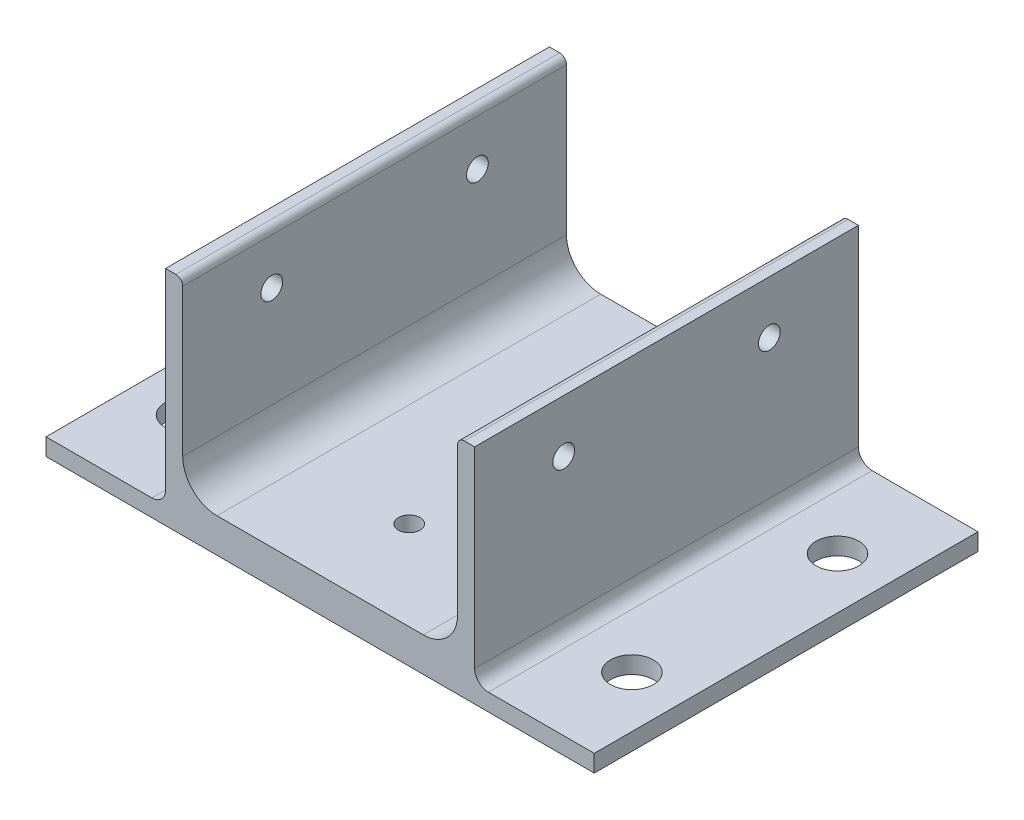
ISO-10303-21;
HEADER;
FILE_DESCRIPTION(('STEP AP214'),'2;1');
FILE_NAME('part.step','',(''),(''),'','','');
FILE_SCHEMA(('AUTOMOTIVE_DESIGN { 1 0 10303 214 1 1 1 1 }'));
ENDSEC;
DATA;
#1=APPLICATION_CONTEXT('core data for automotive mechanical design processes');
#2=APPLICATION_PROTOCOL_DEFINITION('international standard','automotive_design',2000,#1);
#3=PRODUCT_CONTEXT('',#1,'mechanical');
#4=PRODUCT('Part','Part','',(#3));
#5=PRODUCT_RELATED_PRODUCT_CATEGORY('part','',(#4));
#6=PRODUCT_DEFINITION_FORMATION('','',#4);
#7=PRODUCT_DEFINITION_CONTEXT('part definition',#1,'design');
#8=PRODUCT_DEFINITION('design','',#6,#7);
#9=PRODUCT_DEFINITION_SHAPE('','',#8);
#10=(LENGTH_UNIT() NAMED_UNIT(*) SI_UNIT(.MILLI.,.METRE.));
#11=(NAMED_UNIT(*) PLANE_ANGLE_UNIT() SI_UNIT($,.RADIAN.));
#12=(NAMED_UNIT(*) SI_UNIT($,.STERADIAN.) SOLID_ANGLE_UNIT());
#13=UNCERTAINTY_MEASURE_WITH_UNIT(LENGTH_MEASURE(1.E-05),#10,'distance_accuracy_value','');
#14=(GEOMETRIC_REPRESENTATION_CONTEXT(3) GLOBAL_UNCERTAINTY_ASSIGNED_CONTEXT((#13)) GLOBAL_UNIT_ASSIGNED_CONTEXT((#10,
#11,#12)) REPRESENTATION_CONTEXT('',''));
#15=CARTESIAN_POINT('',(0.,0.,0.));
#16=DIRECTION('',(0.,0.,1.));
#17=DIRECTION('',(1.,0.,0.));
#18=AXIS2_PLACEMENT_3D('',#15,#16,#17);
#19=CARTESIAN_POINT('',(25.4635,34.925,54.61));
#20=DIRECTION('',(0.,-1.,0.));
#21=DIRECTION('',(1.,0.,0.));
#22=AXIS2_PLACEMENT_3D('',#19,#20,#21);
#23=CYLINDRICAL_SURFACE('',#22,2.0193);
#24=CARTESIAN_POINT('',(25.4635,0.,54.61));
#25=DIRECTION('',(0.,-1.,0.));
#26=DIRECTION('',(1.,0.,0.));
#27=AXIS2_PLACEMENT_3D('',#24,#25,#26);
#28=CIRCLE('',#27,2.0193);
#29=CARTESIAN_POINT('',(27.4828,0.,54.61));
#30=VERTEX_POINT('',#29);
#31=EDGE_CURVE('E402',#30,#30,#28,.T.);
#32=ORIENTED_EDGE('',*,*,#31,.F.);
#33=EDGE_LOOP('',(#32));
#34=FACE_BOUND('',#33,.T.);
#35=CARTESIAN_POINT('',(25.4635,-3.17499999999999,54.61));
#36=DIRECTION('',(0.,-1.,0.));
#37=DIRECTION('',(1.,0.,0.));
#38=AXIS2_PLACEMENT_3D('',#35,#36,#37);
#39=CIRCLE('',#38,2.0193);
#40=CARTESIAN_POINT('',(27.4828,-3.17499999999999,54.61));
#41=VERTEX_POINT('',#40);
#42=EDGE_CURVE('E43',#41,#41,#39,.F.);
#43=ORIENTED_EDGE('',*,*,#42,.F.);
#44=EDGE_LOOP('',(#43));
#45=FACE_BOUND('',#44,.T.);
#46=ADVANCED_FACE('F39',(#34,#45),#23,.F.);
#47=CARTESIAN_POINT('',(25.4635,34.925,16.51));
#48=DIRECTION('',(0.,-1.,0.));
#49=DIRECTION('',(1.,0.,0.));
#50=AXIS2_PLACEMENT_3D('',#47,#48,#49);
#51=CYLINDRICAL_SURFACE('',#50,2.0193);
#52=CARTESIAN_POINT('',(25.4635,0.,16.51));
#53=DIRECTION('',(0.,-1.,0.));
#54=DIRECTION('',(1.,0.,0.));
#55=AXIS2_PLACEMENT_3D('',#52,#53,#54);
#56=CIRCLE('',#55,2.0193);
#57=CARTESIAN_POINT('',(27.4828,0.,16.51));
#58=VERTEX_POINT('',#57);
#59=EDGE_CURVE('E406',#58,#58,#56,.T.);
#60=ORIENTED_EDGE('',*,*,#59,.F.);
#61=EDGE_LOOP('',(#60));
#62=FACE_BOUND('',#61,.T.);
#63=CARTESIAN_POINT('',(25.4635,-3.17499999999999,16.51));
#64=DIRECTION('',(0.,-1.,0.));
#65=DIRECTION('',(1.,0.,0.));
#66=AXIS2_PLACEMENT_3D('',#63,#64,#65);
#67=CIRCLE('',#66,2.0193);
#68=CARTESIAN_POINT('',(27.4828,-3.17499999999999,16.51));
#69=VERTEX_POINT('',#68);
#70=EDGE_CURVE('E354',#69,#69,#67,.F.);
#71=ORIENTED_EDGE('',*,*,#70,.F.);
#72=EDGE_LOOP('',(#71));
#73=FACE_BOUND('',#72,.T.);
#74=ADVANCED_FACE('F471',(#62,#73),#51,.F.);
#75=CARTESIAN_POINT('',(6.35,6.34999999999999,71.12));
#76=DIRECTION('',(0.,0.,-1.));
#77=DIRECTION('',(-1.,0.,0.));
#78=AXIS2_PLACEMENT_3D('',#75,#76,#77);
#79=CYLINDRICAL_SURFACE('',#78,6.35);
#80=CARTESIAN_POINT('',(6.35,6.34999999999999,0.));
#81=DIRECTION('',(0.,0.,-1.));
#82=DIRECTION('',(1.,0.,0.));
#83=AXIS2_PLACEMENT_3D('',#80,#81,#82);
#84=CIRCLE('',#83,6.35);
#85=CARTESIAN_POINT('',(6.35,0.,0.));
#86=VERTEX_POINT('',#85);
#87=CARTESIAN_POINT('',(0.,6.34999999999999,0.));
#88=VERTEX_POINT('',#87);
#89=EDGE_CURVE('E225',#86,#88,#84,.T.);
#90=ORIENTED_EDGE('',*,*,#89,.T.);
#91=DIRECTION('',(0.,0.,-1.));
#92=VECTOR('',#91,1.);
#93=CARTESIAN_POINT('',(0.,6.34999999999999,71.12));
#94=LINE('',#93,#92);
#95=CARTESIAN_POINT('',(0.,6.34999999999999,71.12));
#96=VERTEX_POINT('',#95);
#97=EDGE_CURVE('E282',#96,#88,#94,.T.);
#98=ORIENTED_EDGE('',*,*,#97,.F.);
#99=CARTESIAN_POINT('',(6.35,6.34999999999999,71.12));
#100=DIRECTION('',(0.,0.,-1.));
#101=DIRECTION('',(1.,0.,0.));
#102=AXIS2_PLACEMENT_3D('',#99,#100,#101);
#103=CIRCLE('',#102,6.35);
#104=CARTESIAN_POINT('',(6.35,0.,71.12));
#105=VERTEX_POINT('',#104);
#106=EDGE_CURVE('E226',#105,#96,#103,.T.);
#107=ORIENTED_EDGE('',*,*,#106,.F.);
#108=DIRECTION('',(0.,0.,-1.));
#109=VECTOR('',#108,1.);
#110=CARTESIAN_POINT('',(6.35,0.,71.12));
#111=LINE('',#110,#109);
#112=EDGE_CURVE('E247',#105,#86,#111,.T.);
#113=ORIENTED_EDGE('',*,*,#112,.T.);
#114=EDGE_LOOP('',(#90,#98,#107,#113));
#115=FACE_BOUND('',#114,.T.);
#116=ADVANCED_FACE('F477',(#115),#79,.F.);
#117=CARTESIAN_POINT('',(0.,6.34999999999999,71.12));
#118=DIRECTION('',(-1.,0.,0.));
#119=DIRECTION('',(0.,-1.,0.));
#120=AXIS2_PLACEMENT_3D('',#117,#118,#119);
#121=PLANE('',#120);
#122=CARTESIAN_POINT('',(0.,25.146,16.51));
#123=DIRECTION('',(-1.,0.,0.));
#124=DIRECTION('',(0.,-1.,0.));
#125=AXIS2_PLACEMENT_3D('',#122,#123,#124);
#126=CIRCLE('',#125,2.0193);
#127=CARTESIAN_POINT('',(0.,23.1267,16.51));
#128=VERTEX_POINT('',#127);
#129=EDGE_CURVE('E426',#128,#128,#126,.T.);
#130=ORIENTED_EDGE('',*,*,#129,.T.);
#131=EDGE_LOOP('',(#130));
#132=FACE_BOUND('',#131,.T.);
#133=CARTESIAN_POINT('',(0.,25.146,54.61));
#134=DIRECTION('',(-1.,0.,0.));
#135=DIRECTION('',(0.,-1.,0.));
#136=AXIS2_PLACEMENT_3D('',#133,#134,#135);
#137=CIRCLE('',#136,2.0193);
#138=CARTESIAN_POINT('',(0.,23.1267,54.61));
#139=VERTEX_POINT('',#138);
#140=EDGE_CURVE('E324',#139,#139,#137,.T.);
#141=ORIENTED_EDGE('',*,*,#140,.T.);
#142=EDGE_LOOP('',(#141));
#143=FACE_BOUND('',#142,.T.);
#144=DIRECTION('',(0.,1.,0.));
#145=VECTOR('',#144,1.);
#146=CARTESIAN_POINT('',(0.,6.34999999999999,0.));
#147=LINE('',#146,#145);
#148=CARTESIAN_POINT('',(0.,33.655,0.));
#149=VERTEX_POINT('',#148);
#150=EDGE_CURVE('E251',#88,#149,#147,.T.);
#151=ORIENTED_EDGE('',*,*,#150,.T.);
#152=DIRECTION('',(0.,0.,-1.));
#153=VECTOR('',#152,1.);
#154=CARTESIAN_POINT('',(0.,33.655,71.12));
#155=LINE('',#154,#153);
#156=CARTESIAN_POINT('',(0.,33.655,71.12));
#157=VERTEX_POINT('',#156);
#158=EDGE_CURVE('E278',#157,#149,#155,.T.);
#159=ORIENTED_EDGE('',*,*,#158,.F.);
#160=DIRECTION('',(0.,1.,0.));
#161=VECTOR('',#160,1.);
#162=CARTESIAN_POINT('',(0.,6.34999999999999,71.12));
#163=LINE('',#162,#161);
#164=EDGE_CURVE('E230',#96,#157,#163,.T.);
#165=ORIENTED_EDGE('',*,*,#164,.F.);
#166=ORIENTED_EDGE('',*,*,#97,.T.);
#167=EDGE_LOOP('',(#151,#159,#165,#166));
#168=FACE_BOUND('',#167,.T.);
#169=ADVANCED_FACE('F534',(#132,#143,#168),#121,.F.);
#170=CARTESIAN_POINT('',(-1.27,33.655,71.12));
#171=DIRECTION('',(0.,0.,-1.));
#172=DIRECTION('',(-1.,0.,0.));
#173=AXIS2_PLACEMENT_3D('',#170,#171,#172);
#174=CYLINDRICAL_SURFACE('',#173,1.27);
#175=CARTESIAN_POINT('',(-1.27,33.655,0.));
#176=DIRECTION('',(0.,0.,1.));
#177=DIRECTION('',(1.,0.,0.));
#178=AXIS2_PLACEMENT_3D('',#175,#176,#177);
#179=CIRCLE('',#178,1.27);
#180=CARTESIAN_POINT('',(-1.27,34.925,0.));
#181=VERTEX_POINT('',#180);
#182=EDGE_CURVE('E254',#149,#181,#179,.T.);
#183=ORIENTED_EDGE('',*,*,#182,.T.);
#184=DIRECTION('',(0.,0.,-1.));
#185=VECTOR('',#184,1.);
#186=CARTESIAN_POINT('',(-1.27,34.925,71.12));
#187=LINE('',#186,#185);
#188=CARTESIAN_POINT('',(-1.27,34.925,71.12));
#189=VERTEX_POINT('',#188);
#190=EDGE_CURVE('E274',#189,#181,#187,.T.);
#191=ORIENTED_EDGE('',*,*,#190,.F.);
#192=CARTESIAN_POINT('',(-1.27,33.655,71.12));
#193=DIRECTION('',(0.,0.,1.));
#194=DIRECTION('',(1.,0.,0.));
#195=AXIS2_PLACEMENT_3D('',#192,#193,#194);
#196=CIRCLE('',#195,1.27);
#197=EDGE_CURVE('E234',#157,#189,#196,.T.);
#198=ORIENTED_EDGE('',*,*,#197,.F.);
#199=ORIENTED_EDGE('',*,*,#158,.T.);
#200=EDGE_LOOP('',(#183,#191,#198,#199));
#201=FACE_BOUND('',#200,.T.);
#202=ADVANCED_FACE('F530',(#201),#174,.T.);
#203=CARTESIAN_POINT('',(-1.27,34.925,71.12));
#204=DIRECTION('',(0.,-1.,0.));
#205=DIRECTION('',(0.,0.,-1.));
#206=AXIS2_PLACEMENT_3D('',#203,#204,#205);
#207=PLANE('',#206);
#208=DIRECTION('',(-1.,0.,0.));
#209=VECTOR('',#208,1.);
#210=CARTESIAN_POINT('',(-1.27,34.925,0.));
#211=LINE('',#210,#209);
#212=CARTESIAN_POINT('',(-3.175,34.925,0.));
#213=VERTEX_POINT('',#212);
#214=EDGE_CURVE('E257',#181,#213,#211,.T.);
#215=ORIENTED_EDGE('',*,*,#214,.T.);
#216=DIRECTION('',(0.,0.,-1.));
#217=VECTOR('',#216,1.);
#218=CARTESIAN_POINT('',(-3.175,34.925,71.12));
#219=LINE('',#218,#217);
#220=CARTESIAN_POINT('',(-3.175,34.925,71.12));
#221=VERTEX_POINT('',#220);
#222=EDGE_CURVE('E270',#221,#213,#219,.T.);
#223=ORIENTED_EDGE('',*,*,#222,.F.);
#224=DIRECTION('',(-1.,0.,0.));
#225=VECTOR('',#224,1.);
#226=CARTESIAN_POINT('',(-1.27,34.925,71.12));
#227=LINE('',#226,#225);
#228=EDGE_CURVE('E237',#189,#221,#227,.T.);
#229=ORIENTED_EDGE('',*,*,#228,.F.);
#230=ORIENTED_EDGE('',*,*,#190,.T.);
#231=EDGE_LOOP('',(#215,#223,#229,#230));
#232=FACE_BOUND('',#231,.T.);
#233=ADVANCED_FACE('F525',(#232),#207,.F.);
#234=CARTESIAN_POINT('',(-3.17500000000001,-3.17499999999999,71.12));
#235=DIRECTION('',(1.,0.,0.));
#236=DIRECTION('',(0.,1.,0.));
#237=AXIS2_PLACEMENT_3D('',#234,#235,#236);
#238=PLANE('',#237);
#239=CARTESIAN_POINT('',(-3.175,25.146,16.51));
#240=DIRECTION('',(-1.,0.,0.));
#241=DIRECTION('',(0.,-1.,0.));
#242=AXIS2_PLACEMENT_3D('',#239,#240,#241);
#243=CIRCLE('',#242,2.0193);
#244=CARTESIAN_POINT('',(-3.175,23.1267,16.51));
#245=VERTEX_POINT('',#244);
#246=EDGE_CURVE('E318',#245,#245,#243,.T.);
#247=ORIENTED_EDGE('',*,*,#246,.F.);
#248=EDGE_LOOP('',(#247));
#249=FACE_BOUND('',#248,.T.);
#250=CARTESIAN_POINT('',(-3.175,25.146,54.61));
#251=DIRECTION('',(-1.,0.,0.));
#252=DIRECTION('',(0.,-1.,0.));
#253=AXIS2_PLACEMENT_3D('',#250,#251,#252);
#254=CIRCLE('',#253,2.0193);
#255=CARTESIAN_POINT('',(-3.175,23.1267,54.61));
#256=VERTEX_POINT('',#255);
#257=EDGE_CURVE('E410',#256,#256,#254,.T.);
#258=ORIENTED_EDGE('',*,*,#257,.F.);
#259=EDGE_LOOP('',(#258));
#260=FACE_BOUND('',#259,.T.);
#261=DIRECTION('',(0.,-1.,0.));
#262=VECTOR('',#261,1.);
#263=CARTESIAN_POINT('',(-3.17500000000001,-3.17499999999999,0.));
#264=LINE('',#263,#262);
#265=CARTESIAN_POINT('',(-3.175,-0.634999999999995,0.));
#266=VERTEX_POINT('',#265);
#267=EDGE_CURVE('E261',#213,#266,#264,.T.);
#268=ORIENTED_EDGE('',*,*,#267,.T.);
#269=DIRECTION('',(0.,0.,-1.));
#270=VECTOR('',#269,1.);
#271=CARTESIAN_POINT('',(-3.175,-0.634999999999995,71.12));
#272=LINE('',#271,#270);
#273=CARTESIAN_POINT('',(-3.175,-0.634999999999997,71.12));
#274=VERTEX_POINT('',#273);
#275=EDGE_CURVE('E338',#266,#274,#272,.F.);
#276=ORIENTED_EDGE('',*,*,#275,.T.);
#277=DIRECTION('',(0.,-1.,0.));
#278=VECTOR('',#277,1.);
#279=CARTESIAN_POINT('',(-3.175,34.925,71.12));
#280=LINE('',#279,#278);
#281=EDGE_CURVE('E240',#221,#274,#280,.T.);
#282=ORIENTED_EDGE('',*,*,#281,.F.);
#283=ORIENTED_EDGE('',*,*,#222,.T.);
#284=EDGE_LOOP('',(#268,#276,#282,#283));
#285=FACE_BOUND('',#284,.T.);
#286=ADVANCED_FACE('F520',(#249,#260,#285),#238,.F.);
#287=CARTESIAN_POINT('',(33.655,0.,71.12));
#288=DIRECTION('',(0.,-1.,0.));
#289=DIRECTION('',(1.,0.,0.));
#290=AXIS2_PLACEMENT_3D('',#287,#288,#289);
#291=PLANE('',#290);
#292=ORIENTED_EDGE('',*,*,#59,.T.);
#293=EDGE_LOOP('',(#292));
#294=FACE_BOUND('',#293,.T.);
#295=ORIENTED_EDGE('',*,*,#31,.T.);
#296=EDGE_LOOP('',(#295));
#297=FACE_BOUND('',#296,.T.);
#298=DIRECTION('',(-1.,0.,0.));
#299=VECTOR('',#298,1.);
#300=CARTESIAN_POINT('',(33.655,0.,71.12));
#301=LINE('',#300,#299);
#302=CARTESIAN_POINT('',(44.577,0.,71.12));
#303=VERTEX_POINT('',#302);
#304=EDGE_CURVE('E244',#303,#105,#301,.T.);
#305=ORIENTED_EDGE('',*,*,#304,.F.);
#306=DIRECTION('',(0.,0.,-1.));
#307=VECTOR('',#306,1.);
#308=CARTESIAN_POINT('',(44.577,0.,71.12));
#309=LINE('',#308,#307);
#310=CARTESIAN_POINT('',(44.577,0.,0.));
#311=VERTEX_POINT('',#310);
#312=EDGE_CURVE('E286',#303,#311,#309,.T.);
#313=ORIENTED_EDGE('',*,*,#312,.T.);
#314=DIRECTION('',(-1.,0.,0.));
#315=VECTOR('',#314,1.);
#316=CARTESIAN_POINT('',(33.655,0.,0.));
#317=LINE('',#316,#315);
#318=EDGE_CURVE('E231',#311,#86,#317,.T.);
#319=ORIENTED_EDGE('',*,*,#318,.T.);
#320=ORIENTED_EDGE('',*,*,#112,.F.);
#321=EDGE_LOOP('',(#305,#313,#319,#320));
#322=FACE_BOUND('',#321,.T.);
#323=ADVANCED_FACE('F543',(#294,#297,#322),#291,.F.);
#324=CARTESIAN_POINT('',(6.35,6.34999999999999,71.12));
#325=DIRECTION('',(0.,0.,1.));
#326=DIRECTION('',(1.,0.,0.));
#327=AXIS2_PLACEMENT_3D('',#324,#325,#326);
#328=PLANE('',#327);
#329=DIRECTION('',(1.,0.,0.));
#330=VECTOR('',#329,1.);
#331=CARTESIAN_POINT('',(54.102,34.925,71.12));
#332=LINE('',#331,#330);
#333=CARTESIAN_POINT('',(52.197,34.925,71.12));
#334=VERTEX_POINT('',#333);
#335=CARTESIAN_POINT('',(54.102,34.925,71.12));
#336=VERTEX_POINT('',#335);
#337=EDGE_CURVE('E209',#334,#336,#332,.T.);
#338=ORIENTED_EDGE('',*,*,#337,.F.);
#339=CARTESIAN_POINT('',(52.197,33.655,71.12));
#340=DIRECTION('',(0.,0.,1.));
#341=DIRECTION('',(1.,0.,0.));
#342=AXIS2_PLACEMENT_3D('',#339,#340,#341);
#343=CIRCLE('',#342,1.27);
#344=CARTESIAN_POINT('',(50.927,33.655,71.12));
#345=VERTEX_POINT('',#344);
#346=EDGE_CURVE('E309',#334,#345,#343,.T.);
#347=ORIENTED_EDGE('',*,*,#346,.T.);
#348=DIRECTION('',(0.,1.,0.));
#349=VECTOR('',#348,1.);
#350=CARTESIAN_POINT('',(50.927,34.925,71.12));
#351=LINE('',#350,#349);
#352=CARTESIAN_POINT('',(50.927,6.35000000000001,71.12));
#353=VERTEX_POINT('',#352);
#354=EDGE_CURVE('E205',#353,#345,#351,.T.);
#355=ORIENTED_EDGE('',*,*,#354,.F.);
#356=CARTESIAN_POINT('',(44.577,6.35,71.12));
#357=DIRECTION('',(0.,0.,1.));
#358=DIRECTION('',(1.,0.,0.));
#359=AXIS2_PLACEMENT_3D('',#356,#357,#358);
#360=CIRCLE('',#359,6.35);
#361=EDGE_CURVE('E296',#353,#303,#360,.F.);
#362=ORIENTED_EDGE('',*,*,#361,.T.);
#363=ORIENTED_EDGE('',*,*,#304,.T.);
#364=ORIENTED_EDGE('',*,*,#106,.T.);
#365=ORIENTED_EDGE('',*,*,#164,.T.);
#366=ORIENTED_EDGE('',*,*,#197,.T.);
#367=ORIENTED_EDGE('',*,*,#228,.T.);
#368=ORIENTED_EDGE('',*,*,#281,.T.);
#369=CARTESIAN_POINT('',(-5.715,-0.634999999999985,71.12));
#370=DIRECTION('',(0.,0.,1.));
#371=DIRECTION('',(1.,0.,0.));
#372=AXIS2_PLACEMENT_3D('',#369,#370,#371);
#373=CIRCLE('',#372,2.54);
#374=CARTESIAN_POINT('',(-5.71500000000001,-3.17499999999999,71.12));
#375=VERTEX_POINT('',#374);
#376=EDGE_CURVE('E350',#274,#375,#373,.F.);
#377=ORIENTED_EDGE('',*,*,#376,.T.);
#378=DIRECTION('',(-1.,0.,0.));
#379=VECTOR('',#378,1.);
#380=CARTESIAN_POINT('',(-25.3365,-3.17499999999998,71.12));
#381=LINE('',#380,#379);
#382=CARTESIAN_POINT('',(-25.3365,-3.17499999999998,71.12));
#383=VERTEX_POINT('',#382);
#384=EDGE_CURVE('E444',#375,#383,#381,.T.);
#385=ORIENTED_EDGE('',*,*,#384,.T.);
#386=DIRECTION('',(0.,1.,0.));
#387=VECTOR('',#386,1.);
#388=CARTESIAN_POINT('',(-25.3365,-6.34999999999998,71.12));
#389=LINE('',#388,#387);
#390=CARTESIAN_POINT('',(-25.3365,-6.34999999999998,71.12));
#391=VERTEX_POINT('',#390);
#392=EDGE_CURVE('E434',#391,#383,#389,.T.);
#393=ORIENTED_EDGE('',*,*,#392,.F.);
#394=DIRECTION('',(-1.,0.,0.));
#395=VECTOR('',#394,1.);
#396=CARTESIAN_POINT('',(-25.3365,-6.34999999999998,71.12));
#397=LINE('',#396,#395);
#398=CARTESIAN_POINT('',(76.2635,-6.35,71.1199999999999));
#399=VERTEX_POINT('',#398);
#400=EDGE_CURVE('E184',#399,#391,#397,.T.);
#401=ORIENTED_EDGE('',*,*,#400,.F.);
#402=DIRECTION('',(0.,1.,0.));
#403=VECTOR('',#402,1.);
#404=CARTESIAN_POINT('',(76.2635,-6.35,71.1199999999999));
#405=LINE('',#404,#403);
#406=CARTESIAN_POINT('',(76.2635,-3.175,71.1199999999999));
#407=VERTEX_POINT('',#406);
#408=EDGE_CURVE('E201',#399,#407,#405,.T.);
#409=ORIENTED_EDGE('',*,*,#408,.T.);
#410=CARTESIAN_POINT('',(56.642,-3.175,71.1199999999999));
#411=VERTEX_POINT('',#410);
#412=EDGE_CURVE('E189',#407,#411,#381,.T.);
#413=ORIENTED_EDGE('',*,*,#412,.T.);
#414=CARTESIAN_POINT('',(56.642,-0.634999999999998,71.12));
#415=DIRECTION('',(0.,0.,1.));
#416=DIRECTION('',(1.,0.,0.));
#417=AXIS2_PLACEMENT_3D('',#414,#415,#416);
#418=CIRCLE('',#417,2.54);
#419=CARTESIAN_POINT('',(54.102,-0.634999999999998,71.12));
#420=VERTEX_POINT('',#419);
#421=EDGE_CURVE('E11',#411,#420,#418,.F.);
#422=ORIENTED_EDGE('',*,*,#421,.T.);
#423=DIRECTION('',(0.,-1.,0.));
#424=VECTOR('',#423,1.);
#425=CARTESIAN_POINT('',(54.102,-3.17499999999999,71.12));
#426=LINE('',#425,#424);
#427=EDGE_CURVE('E213',#336,#420,#426,.T.);
#428=ORIENTED_EDGE('',*,*,#427,.F.);
#429=EDGE_LOOP('',(#338,#347,#355,#362,#363,#364,#365,#366,#367,#368,#377,#385,#393,#401,#409,
#413,#422,#428));
#430=FACE_BOUND('',#429,.T.);
#431=ADVANCED_FACE('F453',(#430),#328,.T.);
#432=CARTESIAN_POINT('',(6.35,6.34999999999999,0.));
#433=DIRECTION('',(0.,0.,1.));
#434=DIRECTION('',(1.,0.,0.));
#435=AXIS2_PLACEMENT_3D('',#432,#433,#434);
#436=PLANE('',#435);
#437=DIRECTION('',(0.,1.,0.));
#438=VECTOR('',#437,1.);
#439=CARTESIAN_POINT('',(50.927,34.925,0.));
#440=LINE('',#439,#438);
#441=CARTESIAN_POINT('',(50.927,6.35000000000001,0.));
#442=VERTEX_POINT('',#441);
#443=CARTESIAN_POINT('',(50.927,33.655,0.));
#444=VERTEX_POINT('',#443);
#445=EDGE_CURVE('E195',#442,#444,#440,.T.);
#446=ORIENTED_EDGE('',*,*,#445,.T.);
#447=CARTESIAN_POINT('',(52.197,33.655,0.));
#448=DIRECTION('',(0.,0.,1.));
#449=DIRECTION('',(1.,0.,0.));
#450=AXIS2_PLACEMENT_3D('',#447,#448,#449);
#451=CIRCLE('',#450,1.27);
#452=CARTESIAN_POINT('',(52.197,34.925,0.));
#453=VERTEX_POINT('',#452);
#454=EDGE_CURVE('E303',#444,#453,#451,.F.);
#455=ORIENTED_EDGE('',*,*,#454,.T.);
#456=DIRECTION('',(1.,0.,0.));
#457=VECTOR('',#456,1.);
#458=CARTESIAN_POINT('',(54.102,34.925,0.));
#459=LINE('',#458,#457);
#460=CARTESIAN_POINT('',(54.102,34.925,0.));
#461=VERTEX_POINT('',#460);
#462=EDGE_CURVE('E199',#453,#461,#459,.T.);
#463=ORIENTED_EDGE('',*,*,#462,.T.);
#464=DIRECTION('',(0.,-1.,0.));
#465=VECTOR('',#464,1.);
#466=CARTESIAN_POINT('',(54.102,-3.17499999999999,0.));
#467=LINE('',#466,#465);
#468=CARTESIAN_POINT('',(54.102,-0.634999999999998,0.));
#469=VERTEX_POINT('',#468);
#470=EDGE_CURVE('E210',#461,#469,#467,.T.);
#471=ORIENTED_EDGE('',*,*,#470,.T.);
#472=CARTESIAN_POINT('',(56.642,-0.634999999999998,0.));
#473=DIRECTION('',(0.,0.,1.));
#474=DIRECTION('',(1.,0.,0.));
#475=AXIS2_PLACEMENT_3D('',#472,#473,#474);
#476=CIRCLE('',#475,2.54);
#477=CARTESIAN_POINT('',(56.642,-3.175,0.));
#478=VERTEX_POINT('',#477);
#479=EDGE_CURVE('E49',#469,#478,#476,.T.);
#480=ORIENTED_EDGE('',*,*,#479,.T.);
#481=DIRECTION('',(1.,0.,0.));
#482=VECTOR('',#481,1.);
#483=CARTESIAN_POINT('',(-25.3365,-3.17499999999998,0.));
#484=LINE('',#483,#482);
#485=CARTESIAN_POINT('',(76.2635,-3.175,0.));
#486=VERTEX_POINT('',#485);
#487=EDGE_CURVE('E437',#478,#486,#484,.T.);
#488=ORIENTED_EDGE('',*,*,#487,.T.);
#489=DIRECTION('',(0.,1.,0.));
#490=VECTOR('',#489,1.);
#491=CARTESIAN_POINT('',(76.2635,-6.35,0.));
#492=LINE('',#491,#490);
#493=CARTESIAN_POINT('',(76.2635,-6.35,0.));
#494=VERTEX_POINT('',#493);
#495=EDGE_CURVE('E174',#494,#486,#492,.T.);
#496=ORIENTED_EDGE('',*,*,#495,.F.);
#497=DIRECTION('',(1.,0.,0.));
#498=VECTOR('',#497,1.);
#499=CARTESIAN_POINT('',(-25.3365,-6.34999999999998,0.));
#500=LINE('',#499,#498);
#501=CARTESIAN_POINT('',(-25.3365,-6.34999999999998,0.));
#502=VERTEX_POINT('',#501);
#503=EDGE_CURVE('E165',#502,#494,#500,.T.);
#504=ORIENTED_EDGE('',*,*,#503,.F.);
#505=DIRECTION('',(0.,1.,0.));
#506=VECTOR('',#505,1.);
#507=CARTESIAN_POINT('',(-25.3365,-6.34999999999998,0.));
#508=LINE('',#507,#506);
#509=CARTESIAN_POINT('',(-25.3365,-3.17499999999998,0.));
#510=VERTEX_POINT('',#509);
#511=EDGE_CURVE('E171',#502,#510,#508,.T.);
#512=ORIENTED_EDGE('',*,*,#511,.T.);
#513=CARTESIAN_POINT('',(-5.715,-3.17499999999999,0.));
#514=VERTEX_POINT('',#513);
#515=EDGE_CURVE('E438',#510,#514,#484,.T.);
#516=ORIENTED_EDGE('',*,*,#515,.T.);
#517=CARTESIAN_POINT('',(-5.715,-0.634999999999985,0.));
#518=DIRECTION('',(0.,0.,1.));
#519=DIRECTION('',(1.,0.,0.));
#520=AXIS2_PLACEMENT_3D('',#517,#518,#519);
#521=CIRCLE('',#520,2.54);
#522=EDGE_CURVE('E347',#514,#266,#521,.T.);
#523=ORIENTED_EDGE('',*,*,#522,.T.);
#524=ORIENTED_EDGE('',*,*,#267,.F.);
#525=ORIENTED_EDGE('',*,*,#214,.F.);
#526=ORIENTED_EDGE('',*,*,#182,.F.);
#527=ORIENTED_EDGE('',*,*,#150,.F.);
#528=ORIENTED_EDGE('',*,*,#89,.F.);
#529=ORIENTED_EDGE('',*,*,#318,.F.);
#530=CARTESIAN_POINT('',(44.577,6.35,0.));
#531=DIRECTION('',(0.,0.,1.));
#532=DIRECTION('',(1.,0.,0.));
#533=AXIS2_PLACEMENT_3D('',#530,#531,#532);
#534=CIRCLE('',#533,6.35);
#535=EDGE_CURVE('E293',#311,#442,#534,.T.);
#536=ORIENTED_EDGE('',*,*,#535,.T.);
#537=EDGE_LOOP('',(#446,#455,#463,#471,#480,#488,#496,#504,#512,#516,#523,#524,#525,#526,#527,
#528,#529,#536));
#538=FACE_BOUND('',#537,.T.);
#539=ADVANCED_FACE('F168',(#538),#436,.F.);
#540=CARTESIAN_POINT('',(54.102,-3.17499999999999,71.12));
#541=DIRECTION('',(1.,0.,0.));
#542=DIRECTION('',(0.,0.,-1.));
#543=AXIS2_PLACEMENT_3D('',#540,#541,#542);
#544=PLANE('',#543);
#545=CARTESIAN_POINT('',(54.102,25.146,16.51));
#546=DIRECTION('',(1.,0.,0.));
#547=DIRECTION('',(0.,0.,-1.));
#548=AXIS2_PLACEMENT_3D('',#545,#546,#547);
#549=CIRCLE('',#548,2.0193);
#550=CARTESIAN_POINT('',(54.102,25.146,14.4907));
#551=VERTEX_POINT('',#550);
#552=EDGE_CURVE('E323',#551,#551,#549,.T.);
#553=ORIENTED_EDGE('',*,*,#552,.F.);
#554=EDGE_LOOP('',(#553));
#555=FACE_BOUND('',#554,.T.);
#556=CARTESIAN_POINT('',(54.102,25.146,54.61));
#557=DIRECTION('',(1.,0.,0.));
#558=DIRECTION('',(0.,0.,-1.));
#559=AXIS2_PLACEMENT_3D('',#556,#557,#558);
#560=CIRCLE('',#559,2.0193);
#561=CARTESIAN_POINT('',(54.102,25.146,52.5907));
#562=VERTEX_POINT('',#561);
#563=EDGE_CURVE('E317',#562,#562,#560,.T.);
#564=ORIENTED_EDGE('',*,*,#563,.F.);
#565=EDGE_LOOP('',(#564));
#566=FACE_BOUND('',#565,.T.);
#567=ORIENTED_EDGE('',*,*,#427,.T.);
#568=DIRECTION('',(0.,0.,-1.));
#569=VECTOR('',#568,1.);
#570=CARTESIAN_POINT('',(54.102,-0.634999999999998,71.12));
#571=LINE('',#570,#569);
#572=EDGE_CURVE('E341',#420,#469,#571,.T.);
#573=ORIENTED_EDGE('',*,*,#572,.T.);
#574=ORIENTED_EDGE('',*,*,#470,.F.);
#575=DIRECTION('',(0.,0.,-1.));
#576=VECTOR('',#575,1.);
#577=CARTESIAN_POINT('',(54.102,34.925,71.12));
#578=LINE('',#577,#576);
#579=EDGE_CURVE('E216',#336,#461,#578,.T.);
#580=ORIENTED_EDGE('',*,*,#579,.F.);
#581=EDGE_LOOP('',(#567,#573,#574,#580));
#582=FACE_BOUND('',#581,.T.);
#583=ADVANCED_FACE('F561',(#555,#566,#582),#544,.T.);
#584=CARTESIAN_POINT('',(54.102,34.925,71.12));
#585=DIRECTION('',(0.,1.,0.));
#586=DIRECTION('',(0.,0.,1.));
#587=AXIS2_PLACEMENT_3D('',#584,#585,#586);
#588=PLANE('',#587);
#589=ORIENTED_EDGE('',*,*,#462,.F.);
#590=DIRECTION('',(0.,0.,-1.));
#591=VECTOR('',#590,1.);
#592=CARTESIAN_POINT('',(52.197,34.925,71.12));
#593=LINE('',#592,#591);
#594=EDGE_CURVE('E306',#453,#334,#593,.F.);
#595=ORIENTED_EDGE('',*,*,#594,.T.);
#596=ORIENTED_EDGE('',*,*,#337,.T.);
#597=ORIENTED_EDGE('',*,*,#579,.T.);
#598=EDGE_LOOP('',(#589,#595,#596,#597));
#599=FACE_BOUND('',#598,.T.);
#600=ADVANCED_FACE('F557',(#599),#588,.T.);
#601=CARTESIAN_POINT('',(50.927,34.925,71.12));
#602=DIRECTION('',(-1.,0.,0.));
#603=DIRECTION('',(0.,-1.,0.));
#604=AXIS2_PLACEMENT_3D('',#601,#602,#603);
#605=PLANE('',#604);
#606=CARTESIAN_POINT('',(50.927,25.146,16.51));
#607=DIRECTION('',(-1.,0.,0.));
#608=DIRECTION('',(0.,-1.,0.));
#609=AXIS2_PLACEMENT_3D('',#606,#607,#608);
#610=CIRCLE('',#609,2.0193);
#611=CARTESIAN_POINT('',(50.927,23.1267,16.51));
#612=VERTEX_POINT('',#611);
#613=EDGE_CURVE('E319',#612,#612,#610,.T.);
#614=ORIENTED_EDGE('',*,*,#613,.F.);
#615=EDGE_LOOP('',(#614));
#616=FACE_BOUND('',#615,.T.);
#617=CARTESIAN_POINT('',(50.927,25.146,54.61));
#618=DIRECTION('',(-1.,0.,0.));
#619=DIRECTION('',(0.,-1.,0.));
#620=AXIS2_PLACEMENT_3D('',#617,#618,#619);
#621=CIRCLE('',#620,2.0193);
#622=CARTESIAN_POINT('',(50.927,23.1267,54.61));
#623=VERTEX_POINT('',#622);
#624=EDGE_CURVE('E313',#623,#623,#621,.T.);
#625=ORIENTED_EDGE('',*,*,#624,.F.);
#626=EDGE_LOOP('',(#625));
#627=FACE_BOUND('',#626,.T.);
#628=ORIENTED_EDGE('',*,*,#354,.T.);
#629=DIRECTION('',(0.,0.,-1.));
#630=VECTOR('',#629,1.);
#631=CARTESIAN_POINT('',(50.927,33.655,71.12));
#632=LINE('',#631,#630);
#633=EDGE_CURVE('E299',#345,#444,#632,.T.);
#634=ORIENTED_EDGE('',*,*,#633,.T.);
#635=ORIENTED_EDGE('',*,*,#445,.F.);
#636=DIRECTION('',(0.,0.,-1.));
#637=VECTOR('',#636,1.);
#638=CARTESIAN_POINT('',(50.927,6.35,71.12));
#639=LINE('',#638,#637);
#640=EDGE_CURVE('E290',#442,#353,#639,.F.);
#641=ORIENTED_EDGE('',*,*,#640,.T.);
#642=EDGE_LOOP('',(#628,#634,#635,#641));
#643=FACE_BOUND('',#642,.T.);
#644=ADVANCED_FACE('F550',(#616,#627,#643),#605,.T.);
#645=CARTESIAN_POINT('',(44.577,6.35,71.12));
#646=DIRECTION('',(0.,0.,-1.));
#647=DIRECTION('',(-1.,0.,0.));
#648=AXIS2_PLACEMENT_3D('',#645,#646,#647);
#649=CYLINDRICAL_SURFACE('',#648,6.35);
#650=ORIENTED_EDGE('',*,*,#361,.F.);
#651=ORIENTED_EDGE('',*,*,#640,.F.);
#652=ORIENTED_EDGE('',*,*,#535,.F.);
#653=ORIENTED_EDGE('',*,*,#312,.F.);
#654=EDGE_LOOP('',(#650,#651,#652,#653));
#655=FACE_BOUND('',#654,.T.);
#656=ADVANCED_FACE('F504',(#655),#649,.F.);
#657=CARTESIAN_POINT('',(52.197,33.655,71.12));
#658=DIRECTION('',(0.,0.,-1.));
#659=DIRECTION('',(-1.,0.,0.));
#660=AXIS2_PLACEMENT_3D('',#657,#658,#659);
#661=CYLINDRICAL_SURFACE('',#660,1.27);
#662=ORIENTED_EDGE('',*,*,#346,.F.);
#663=ORIENTED_EDGE('',*,*,#594,.F.);
#664=ORIENTED_EDGE('',*,*,#454,.F.);
#665=ORIENTED_EDGE('',*,*,#633,.F.);
#666=EDGE_LOOP('',(#662,#663,#664,#665));
#667=FACE_BOUND('',#666,.T.);
#668=ADVANCED_FACE('F499',(#667),#661,.T.);
#669=CARTESIAN_POINT('',(0.,-3.17499999999999,0.));
#670=DIRECTION('',(0.,-1.,0.));
#671=DIRECTION('',(1.,0.,0.));
#672=AXIS2_PLACEMENT_3D('',#669,#670,#671);
#673=PLANE('',#672);
#674=CARTESIAN_POINT('',(-15.8115,-3.17499999999998,54.61));
#675=DIRECTION('',(0.,-1.,0.));
#676=DIRECTION('',(1.,0.,0.));
#677=AXIS2_PLACEMENT_3D('',#674,#675,#676);
#678=CIRCLE('',#677,3.96875);
#679=CARTESIAN_POINT('',(-11.84275,-3.17499999999998,54.61));
#680=VERTEX_POINT('',#679);
#681=EDGE_CURVE('E398',#680,#680,#678,.T.);
#682=ORIENTED_EDGE('',*,*,#681,.T.);
#683=EDGE_LOOP('',(#682));
#684=FACE_BOUND('',#683,.T.);
#685=CARTESIAN_POINT('',(-15.8115,-3.17499999999998,16.51));
#686=DIRECTION('',(0.,-1.,0.));
#687=DIRECTION('',(1.,0.,0.));
#688=AXIS2_PLACEMENT_3D('',#685,#686,#687);
#689=CIRCLE('',#688,3.96875);
#690=CARTESIAN_POINT('',(-11.84275,-3.17499999999998,16.51));
#691=VERTEX_POINT('',#690);
#692=EDGE_CURVE('E334',#691,#691,#689,.T.);
#693=ORIENTED_EDGE('',*,*,#692,.T.);
#694=EDGE_LOOP('',(#693));
#695=FACE_BOUND('',#694,.T.);
#696=ORIENTED_EDGE('',*,*,#384,.F.);
#697=DIRECTION('',(0.,0.,-1.));
#698=VECTOR('',#697,1.);
#699=CARTESIAN_POINT('',(-5.715,-3.17499999999999,0.));
#700=LINE('',#699,#698);
#701=EDGE_CURVE('E312',#375,#514,#700,.T.);
#702=ORIENTED_EDGE('',*,*,#701,.T.);
#703=ORIENTED_EDGE('',*,*,#515,.F.);
#704=DIRECTION('',(0.,0.,-1.));
#705=VECTOR('',#704,1.);
#706=CARTESIAN_POINT('',(-25.3365,-3.17499999999998,71.12));
#707=LINE('',#706,#705);
#708=EDGE_CURVE('E193',#383,#510,#707,.T.);
#709=ORIENTED_EDGE('',*,*,#708,.F.);
#710=EDGE_LOOP('',(#696,#702,#703,#709));
#711=FACE_BOUND('',#710,.T.);
#712=ADVANCED_FACE('F467',(#684,#695,#711),#673,.F.);
#713=CARTESIAN_POINT('',(-25.3365,-6.34999999999998,71.12));
#714=DIRECTION('',(1.,0.,0.));
#715=DIRECTION('',(0.,1.,0.));
#716=AXIS2_PLACEMENT_3D('',#713,#714,#715);
#717=PLANE('',#716);
#718=ORIENTED_EDGE('',*,*,#708,.T.);
#719=ORIENTED_EDGE('',*,*,#511,.F.);
#720=DIRECTION('',(0.,0.,-1.));
#721=VECTOR('',#720,1.);
#722=CARTESIAN_POINT('',(-25.3365,-6.34999999999998,71.12));
#723=LINE('',#722,#721);
#724=EDGE_CURVE('E179',#391,#502,#723,.T.);
#725=ORIENTED_EDGE('',*,*,#724,.F.);
#726=ORIENTED_EDGE('',*,*,#392,.T.);
#727=EDGE_LOOP('',(#718,#719,#725,#726));
#728=FACE_BOUND('',#727,.T.);
#729=ADVANCED_FACE('F191',(#728),#717,.F.);
#730=CARTESIAN_POINT('',(76.2635,-6.35,71.1199999999999));
#731=DIRECTION('',(-1.,0.,0.));
#732=DIRECTION('',(0.,-1.,0.));
#733=AXIS2_PLACEMENT_3D('',#730,#731,#732);
#734=PLANE('',#733);
#735=DIRECTION('',(0.,0.,1.));
#736=VECTOR('',#735,1.);
#737=CARTESIAN_POINT('',(76.2635,-3.175,71.1199999999999));
#738=LINE('',#737,#736);
#739=EDGE_CURVE('E441',#486,#407,#738,.T.);
#740=ORIENTED_EDGE('',*,*,#739,.T.);
#741=ORIENTED_EDGE('',*,*,#408,.F.);
#742=DIRECTION('',(0.,0.,1.));
#743=VECTOR('',#742,1.);
#744=CARTESIAN_POINT('',(76.2635,-6.35,71.1199999999999));
#745=LINE('',#744,#743);
#746=EDGE_CURVE('E178',#494,#399,#745,.T.);
#747=ORIENTED_EDGE('',*,*,#746,.F.);
#748=ORIENTED_EDGE('',*,*,#495,.T.);
#749=EDGE_LOOP('',(#740,#741,#747,#748));
#750=FACE_BOUND('',#749,.T.);
#751=ADVANCED_FACE('F458',(#750),#734,.F.);
#752=CARTESIAN_POINT('',(0.,-6.34999999999999,0.));
#753=DIRECTION('',(0.,-1.,0.));
#754=DIRECTION('',(1.,0.,0.));
#755=AXIS2_PLACEMENT_3D('',#752,#753,#754);
#756=PLANE('',#755);
#757=CARTESIAN_POINT('',(25.4635,-6.34999999999999,54.61));
#758=DIRECTION('',(0.,-1.,0.));
#759=DIRECTION('',(1.,0.,0.));
#760=AXIS2_PLACEMENT_3D('',#757,#758,#759);
#761=CIRCLE('',#760,5.08);
#762=CARTESIAN_POINT('',(30.5435,-6.34999999999999,54.61));
#763=VERTEX_POINT('',#762);
#764=EDGE_CURVE('E365',#763,#763,#761,.T.);
#765=ORIENTED_EDGE('',*,*,#764,.F.);
#766=EDGE_LOOP('',(#765));
#767=FACE_BOUND('',#766,.T.);
#768=CARTESIAN_POINT('',(25.4635,-6.34999999999999,16.51));
#769=DIRECTION('',(0.,-1.,0.));
#770=DIRECTION('',(1.,0.,0.));
#771=AXIS2_PLACEMENT_3D('',#768,#769,#770);
#772=CIRCLE('',#771,5.08);
#773=CARTESIAN_POINT('',(30.5435,-6.34999999999999,16.51));
#774=VERTEX_POINT('',#773);
#775=EDGE_CURVE('E377',#774,#774,#772,.T.);
#776=ORIENTED_EDGE('',*,*,#775,.F.);
#777=EDGE_LOOP('',(#776));
#778=FACE_BOUND('',#777,.T.);
#779=CARTESIAN_POINT('',(66.7385,-6.35,16.51));
#780=DIRECTION('',(0.,-1.,0.));
#781=DIRECTION('',(1.,0.,0.));
#782=AXIS2_PLACEMENT_3D('',#779,#780,#781);
#783=CIRCLE('',#782,3.96874999999999);
#784=CARTESIAN_POINT('',(70.70725,-6.35,16.51));
#785=VERTEX_POINT('',#784);
#786=EDGE_CURVE('E363',#785,#785,#783,.T.);
#787=ORIENTED_EDGE('',*,*,#786,.F.);
#788=EDGE_LOOP('',(#787));
#789=FACE_BOUND('',#788,.T.);
#790=CARTESIAN_POINT('',(66.7385,-6.35,54.61));
#791=DIRECTION('',(0.,-1.,0.));
#792=DIRECTION('',(1.,0.,0.));
#793=AXIS2_PLACEMENT_3D('',#790,#791,#792);
#794=CIRCLE('',#793,3.96874999999999);
#795=CARTESIAN_POINT('',(70.70725,-6.35,54.61));
#796=VERTEX_POINT('',#795);
#797=EDGE_CURVE('E385',#796,#796,#794,.T.);
#798=ORIENTED_EDGE('',*,*,#797,.F.);
#799=EDGE_LOOP('',(#798));
#800=FACE_BOUND('',#799,.T.);
#801=CARTESIAN_POINT('',(-15.8115,-6.34999999999998,54.61));
#802=DIRECTION('',(0.,-1.,0.));
#803=DIRECTION('',(1.,0.,0.));
#804=AXIS2_PLACEMENT_3D('',#801,#802,#803);
#805=CIRCLE('',#804,3.96875);
#806=CARTESIAN_POINT('',(-11.84275,-6.34999999999998,54.61));
#807=VERTEX_POINT('',#806);
#808=EDGE_CURVE('E381',#807,#807,#805,.T.);
#809=ORIENTED_EDGE('',*,*,#808,.F.);
#810=EDGE_LOOP('',(#809));
#811=FACE_BOUND('',#810,.T.);
#812=CARTESIAN_POINT('',(-15.8115,-6.34999999999998,16.51));
#813=DIRECTION('',(0.,-1.,0.));
#814=DIRECTION('',(1.,0.,0.));
#815=AXIS2_PLACEMENT_3D('',#812,#813,#814);
#816=CIRCLE('',#815,3.96875);
#817=CARTESIAN_POINT('',(-11.84275,-6.34999999999998,16.51));
#818=VERTEX_POINT('',#817);
#819=EDGE_CURVE('E330',#818,#818,#816,.T.);
#820=ORIENTED_EDGE('',*,*,#819,.F.);
#821=EDGE_LOOP('',(#820));
#822=FACE_BOUND('',#821,.T.);
#823=ORIENTED_EDGE('',*,*,#724,.T.);
#824=ORIENTED_EDGE('',*,*,#503,.T.);
#825=ORIENTED_EDGE('',*,*,#746,.T.);
#826=ORIENTED_EDGE('',*,*,#400,.T.);
#827=EDGE_LOOP('',(#823,#824,#825,#826));
#828=FACE_BOUND('',#827,.T.);
#829=ADVANCED_FACE('F182',(#767,#778,#789,#800,#811,#822,#828),#756,.T.);
#830=CARTESIAN_POINT('',(66.7385,-3.175,16.51));
#831=DIRECTION('',(0.,-1.,0.));
#832=DIRECTION('',(1.,0.,0.));
#833=AXIS2_PLACEMENT_3D('',#830,#831,#832);
#834=CIRCLE('',#833,3.96874999999999);
#835=CARTESIAN_POINT('',(70.70725,-3.175,16.51));
#836=VERTEX_POINT('',#835);
#837=EDGE_CURVE('E329',#836,#836,#834,.T.);
#838=ORIENTED_EDGE('',*,*,#837,.T.);
#839=EDGE_LOOP('',(#838));
#840=FACE_BOUND('',#839,.T.);
#841=CARTESIAN_POINT('',(66.7385,-3.175,54.61));
#842=DIRECTION('',(0.,-1.,0.));
#843=DIRECTION('',(1.,0.,0.));
#844=AXIS2_PLACEMENT_3D('',#841,#842,#843);
#845=CIRCLE('',#844,3.96874999999999);
#846=CARTESIAN_POINT('',(70.70725,-3.175,54.61));
#847=VERTEX_POINT('',#846);
#848=EDGE_CURVE('E325',#847,#847,#845,.T.);
#849=ORIENTED_EDGE('',*,*,#848,.T.);
#850=EDGE_LOOP('',(#849));
#851=FACE_BOUND('',#850,.T.);
#852=ORIENTED_EDGE('',*,*,#487,.F.);
#853=DIRECTION('',(0.,0.,-1.));
#854=VECTOR('',#853,1.);
#855=CARTESIAN_POINT('',(56.642,-3.175,0.));
#856=LINE('',#855,#854);
#857=EDGE_CURVE('E63',#478,#411,#856,.F.);
#858=ORIENTED_EDGE('',*,*,#857,.T.);
#859=ORIENTED_EDGE('',*,*,#412,.F.);
#860=ORIENTED_EDGE('',*,*,#739,.F.);
#861=EDGE_LOOP('',(#852,#858,#859,#860));
#862=FACE_BOUND('',#861,.T.);
#863=ADVANCED_FACE('F457',(#840,#851,#862),#673,.F.);
#864=CARTESIAN_POINT('',(76.2635,25.146,54.61));
#865=DIRECTION('',(-1.,0.,0.));
#866=DIRECTION('',(0.,-1.,0.));
#867=AXIS2_PLACEMENT_3D('',#864,#865,#866);
#868=CYLINDRICAL_SURFACE('',#867,2.0193);
#869=ORIENTED_EDGE('',*,*,#563,.T.);
#870=EDGE_LOOP('',(#869));
#871=FACE_BOUND('',#870,.T.);
#872=ORIENTED_EDGE('',*,*,#624,.T.);
#873=EDGE_LOOP('',(#872));
#874=FACE_BOUND('',#873,.T.);
#875=ADVANCED_FACE('F488',(#871,#874),#868,.F.);
#876=CARTESIAN_POINT('',(76.2635,25.146,16.51));
#877=DIRECTION('',(-1.,0.,0.));
#878=DIRECTION('',(0.,-1.,0.));
#879=AXIS2_PLACEMENT_3D('',#876,#877,#878);
#880=CYLINDRICAL_SURFACE('',#879,2.0193);
#881=ORIENTED_EDGE('',*,*,#552,.T.);
#882=EDGE_LOOP('',(#881));
#883=FACE_BOUND('',#882,.T.);
#884=ORIENTED_EDGE('',*,*,#613,.T.);
#885=EDGE_LOOP('',(#884));
#886=FACE_BOUND('',#885,.T.);
#887=ADVANCED_FACE('F484',(#883,#886),#880,.F.);
#888=ORIENTED_EDGE('',*,*,#257,.T.);
#889=EDGE_LOOP('',(#888));
#890=FACE_BOUND('',#889,.T.);
#891=ORIENTED_EDGE('',*,*,#140,.F.);
#892=EDGE_LOOP('',(#891));
#893=FACE_BOUND('',#892,.T.);
#894=ADVANCED_FACE('F487',(#890,#893),#868,.F.);
#895=ORIENTED_EDGE('',*,*,#246,.T.);
#896=EDGE_LOOP('',(#895));
#897=FACE_BOUND('',#896,.T.);
#898=ORIENTED_EDGE('',*,*,#129,.F.);
#899=EDGE_LOOP('',(#898));
#900=FACE_BOUND('',#899,.T.);
#901=ADVANCED_FACE('F490',(#897,#900),#880,.F.);
#902=CARTESIAN_POINT('',(66.7385,34.925,54.61));
#903=DIRECTION('',(0.,-1.,0.));
#904=DIRECTION('',(1.,0.,0.));
#905=AXIS2_PLACEMENT_3D('',#902,#903,#904);
#906=CYLINDRICAL_SURFACE('',#905,3.96874999999999);
#907=ORIENTED_EDGE('',*,*,#797,.T.);
#908=EDGE_LOOP('',(#907));
#909=FACE_BOUND('',#908,.T.);
#910=ORIENTED_EDGE('',*,*,#848,.F.);
#911=EDGE_LOOP('',(#910));
#912=FACE_BOUND('',#911,.T.);
#913=ADVANCED_FACE('F765',(#909,#912),#906,.F.);
#914=CARTESIAN_POINT('',(66.7385,34.925,16.51));
#915=DIRECTION('',(0.,-1.,0.));
#916=DIRECTION('',(1.,0.,0.));
#917=AXIS2_PLACEMENT_3D('',#914,#915,#916);
#918=CYLINDRICAL_SURFACE('',#917,3.96874999999999);
#919=ORIENTED_EDGE('',*,*,#786,.T.);
#920=EDGE_LOOP('',(#919));
#921=FACE_BOUND('',#920,.T.);
#922=ORIENTED_EDGE('',*,*,#837,.F.);
#923=EDGE_LOOP('',(#922));
#924=FACE_BOUND('',#923,.T.);
#925=ADVANCED_FACE('F768',(#921,#924),#918,.F.);
#926=CARTESIAN_POINT('',(-15.8115,34.925,16.51));
#927=DIRECTION('',(0.,-1.,0.));
#928=DIRECTION('',(1.,0.,0.));
#929=AXIS2_PLACEMENT_3D('',#926,#927,#928);
#930=CYLINDRICAL_SURFACE('',#929,3.96875);
#931=ORIENTED_EDGE('',*,*,#819,.T.);
#932=EDGE_LOOP('',(#931));
#933=FACE_BOUND('',#932,.T.);
#934=ORIENTED_EDGE('',*,*,#692,.F.);
#935=EDGE_LOOP('',(#934));
#936=FACE_BOUND('',#935,.T.);
#937=ADVANCED_FACE('F577',(#933,#936),#930,.F.);
#938=CARTESIAN_POINT('',(-15.8115,34.925,54.61));
#939=DIRECTION('',(0.,-1.,0.));
#940=DIRECTION('',(1.,0.,0.));
#941=AXIS2_PLACEMENT_3D('',#938,#939,#940);
#942=CYLINDRICAL_SURFACE('',#941,3.96875);
#943=ORIENTED_EDGE('',*,*,#808,.T.);
#944=EDGE_LOOP('',(#943));
#945=FACE_BOUND('',#944,.T.);
#946=ORIENTED_EDGE('',*,*,#681,.F.);
#947=EDGE_LOOP('',(#946));
#948=FACE_BOUND('',#947,.T.);
#949=ADVANCED_FACE('F573',(#945,#948),#942,.F.);
#950=CARTESIAN_POINT('',(-5.715,-0.634999999999985,0.));
#951=DIRECTION('',(0.,0.,1.));
#952=DIRECTION('',(0.,-1.,0.));
#953=AXIS2_PLACEMENT_3D('',#950,#951,#952);
#954=CYLINDRICAL_SURFACE('',#953,2.54);
#955=ORIENTED_EDGE('',*,*,#376,.F.);
#956=ORIENTED_EDGE('',*,*,#275,.F.);
#957=ORIENTED_EDGE('',*,*,#522,.F.);
#958=ORIENTED_EDGE('',*,*,#701,.F.);
#959=EDGE_LOOP('',(#955,#956,#957,#958));
#960=FACE_BOUND('',#959,.T.);
#961=ADVANCED_FACE('F516',(#960),#954,.F.);
#962=CARTESIAN_POINT('',(56.642,-0.634999999999998,71.12));
#963=DIRECTION('',(0.,0.,-1.));
#964=DIRECTION('',(0.,1.,0.));
#965=AXIS2_PLACEMENT_3D('',#962,#963,#964);
#966=CYLINDRICAL_SURFACE('',#965,2.54);
#967=ORIENTED_EDGE('',*,*,#421,.F.);
#968=ORIENTED_EDGE('',*,*,#857,.F.);
#969=ORIENTED_EDGE('',*,*,#479,.F.);
#970=ORIENTED_EDGE('',*,*,#572,.F.);
#971=EDGE_LOOP('',(#967,#968,#969,#970));
#972=FACE_BOUND('',#971,.T.);
#973=ADVANCED_FACE('F41',(#972),#966,.F.);
#974=CARTESIAN_POINT('',(25.4635,-3.17499999999999,16.51));
#975=DIRECTION('',(0.,-1.,0.));
#976=DIRECTION('',(1.,0.,0.));
#977=AXIS2_PLACEMENT_3D('',#974,#975,#976);
#978=PLANE('',#977);
#979=CARTESIAN_POINT('',(25.4635,-3.17499999999999,16.51));
#980=DIRECTION('',(0.,-1.,0.));
#981=DIRECTION('',(1.,0.,0.));
#982=AXIS2_PLACEMENT_3D('',#979,#980,#981);
#983=CIRCLE('',#982,5.08);
#984=CARTESIAN_POINT('',(30.5435,-3.17499999999999,16.51));
#985=VERTEX_POINT('',#984);
#986=EDGE_CURVE('E371',#985,#985,#983,.T.);
#987=ORIENTED_EDGE('',*,*,#986,.T.);
#988=EDGE_LOOP('',(#987));
#989=FACE_BOUND('',#988,.T.);
#990=ORIENTED_EDGE('',*,*,#70,.T.);
#991=EDGE_LOOP('',(#990));
#992=FACE_BOUND('',#991,.T.);
#993=ADVANCED_FACE('F565',(#989,#992),#978,.T.);
#994=CARTESIAN_POINT('',(25.4635,-3.17499999999999,16.51));
#995=DIRECTION('',(0.,-1.,0.));
#996=DIRECTION('',(1.,0.,0.));
#997=AXIS2_PLACEMENT_3D('',#994,#995,#996);
#998=CYLINDRICAL_SURFACE('',#997,5.08);
#999=ORIENTED_EDGE('',*,*,#986,.F.);
#1000=EDGE_LOOP('',(#999));
#1001=FACE_BOUND('',#1000,.T.);
#1002=ORIENTED_EDGE('',*,*,#775,.T.);
#1003=EDGE_LOOP('',(#1002));
#1004=FACE_BOUND('',#1003,.T.);
#1005=ADVANCED_FACE('F570',(#1001,#1004),#998,.F.);
#1006=CARTESIAN_POINT('',(25.4635,-3.17499999999999,54.61));
#1007=DIRECTION('',(0.,-1.,0.));
#1008=DIRECTION('',(1.,0.,0.));
#1009=AXIS2_PLACEMENT_3D('',#1006,#1007,#1008);
#1010=PLANE('',#1009);
#1011=CARTESIAN_POINT('',(25.4635,-3.17499999999999,54.61));
#1012=DIRECTION('',(0.,-1.,0.));
#1013=DIRECTION('',(1.,0.,0.));
#1014=AXIS2_PLACEMENT_3D('',#1011,#1012,#1013);
#1015=CIRCLE('',#1014,5.08);
#1016=CARTESIAN_POINT('',(30.5435,-3.17499999999999,54.61));
#1017=VERTEX_POINT('',#1016);
#1018=EDGE_CURVE('E357',#1017,#1017,#1015,.T.);
#1019=ORIENTED_EDGE('',*,*,#1018,.T.);
#1020=EDGE_LOOP('',(#1019));
#1021=FACE_BOUND('',#1020,.T.);
#1022=ORIENTED_EDGE('',*,*,#42,.T.);
#1023=EDGE_LOOP('',(#1022));
#1024=FACE_BOUND('',#1023,.T.);
#1025=ADVANCED_FACE('F740',(#1021,#1024),#1010,.T.);
#1026=CARTESIAN_POINT('',(25.4635,-3.17499999999999,54.61));
#1027=DIRECTION('',(0.,-1.,0.));
#1028=DIRECTION('',(1.,0.,0.));
#1029=AXIS2_PLACEMENT_3D('',#1026,#1027,#1028);
#1030=CYLINDRICAL_SURFACE('',#1029,5.08);
#1031=ORIENTED_EDGE('',*,*,#1018,.F.);
#1032=EDGE_LOOP('',(#1031));
#1033=FACE_BOUND('',#1032,.T.);
#1034=ORIENTED_EDGE('',*,*,#764,.T.);
#1035=EDGE_LOOP('',(#1034));
#1036=FACE_BOUND('',#1035,.T.);
#1037=ADVANCED_FACE('F750',(#1033,#1036),#1030,.F.);
#1038=CLOSED_SHELL('',(#46,#74,#116,#169,#202,#233,#286,#323,#431,#539,#583,#600,#644,#656,#668,
#712,#729,#751,#829,#863,#875,#887,#894,#901,#913,#925,#937,#949,#961,#973,#993,#1005,#1025,#1037));
#1039=MANIFOLD_SOLID_BREP('B2',#1038);
#1040=ADVANCED_BREP_SHAPE_REPRESENTATION('',(#18,#1039),#14);
#1041=SHAPE_DEFINITION_REPRESENTATION(#9,#1040);
ENDSEC;
END-ISO-10303-21;
